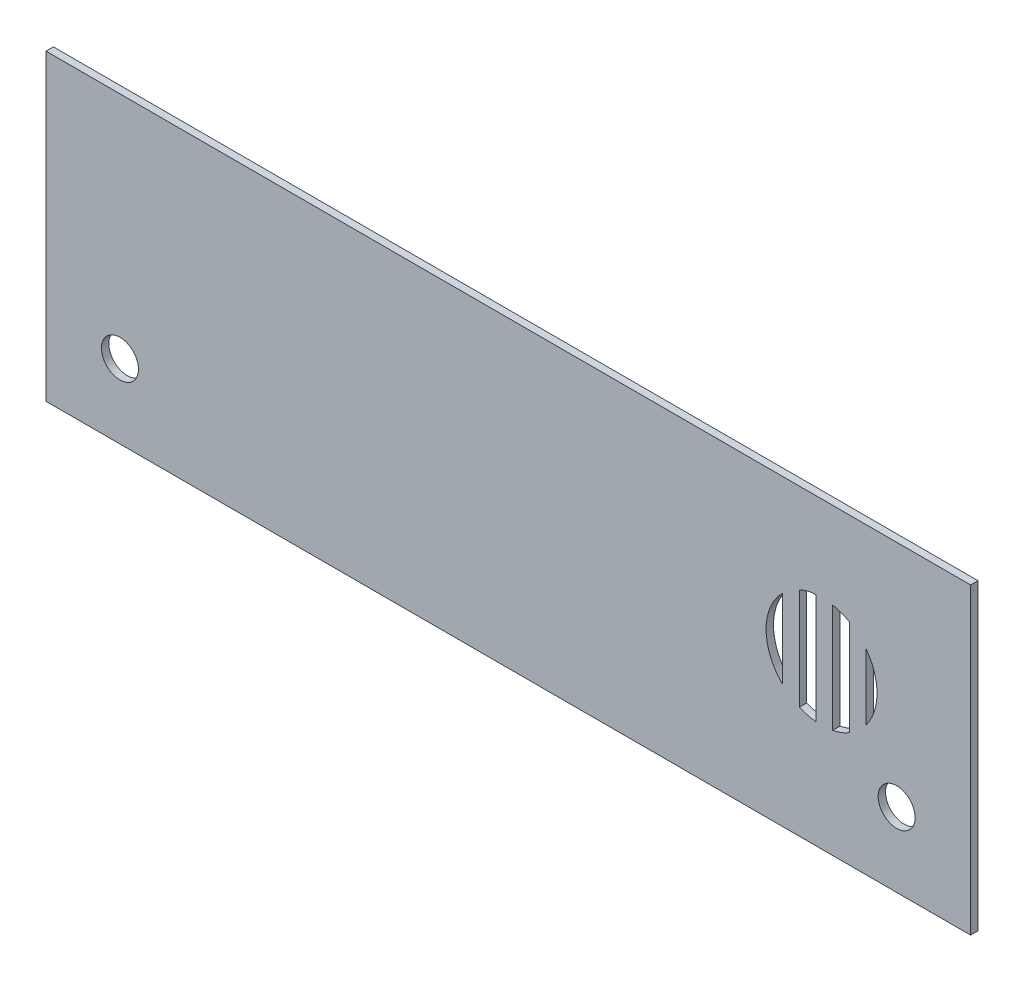
ISO-10303-21;
HEADER;
FILE_DESCRIPTION(('STEP AP214'),'2;1');
FILE_NAME('part.step','',(''),(''),'','','');
FILE_SCHEMA(('AUTOMOTIVE_DESIGN { 1 0 10303 214 1 1 1 1 }'));
ENDSEC;
DATA;
#1=APPLICATION_CONTEXT('core data for automotive mechanical design processes');
#2=APPLICATION_PROTOCOL_DEFINITION('international standard','automotive_design',2000,#1);
#3=PRODUCT_CONTEXT('',#1,'mechanical');
#4=PRODUCT('Part','Part','',(#3));
#5=PRODUCT_RELATED_PRODUCT_CATEGORY('part','',(#4));
#6=PRODUCT_DEFINITION_FORMATION('','',#4);
#7=PRODUCT_DEFINITION_CONTEXT('part definition',#1,'design');
#8=PRODUCT_DEFINITION('design','',#6,#7);
#9=PRODUCT_DEFINITION_SHAPE('','',#8);
#10=(LENGTH_UNIT() NAMED_UNIT(*) SI_UNIT(.MILLI.,.METRE.));
#11=(NAMED_UNIT(*) PLANE_ANGLE_UNIT() SI_UNIT($,.RADIAN.));
#12=(NAMED_UNIT(*) SI_UNIT($,.STERADIAN.) SOLID_ANGLE_UNIT());
#13=UNCERTAINTY_MEASURE_WITH_UNIT(LENGTH_MEASURE(1.E-05),#10,'distance_accuracy_value','');
#14=(GEOMETRIC_REPRESENTATION_CONTEXT(3) GLOBAL_UNCERTAINTY_ASSIGNED_CONTEXT((#13)) GLOBAL_UNIT_ASSIGNED_CONTEXT((#10,
#11,#12)) REPRESENTATION_CONTEXT('',''));
#15=CARTESIAN_POINT('',(0.,0.,0.));
#16=DIRECTION('',(0.,0.,1.));
#17=DIRECTION('',(1.,0.,0.));
#18=AXIS2_PLACEMENT_3D('',#15,#16,#17);
#19=CARTESIAN_POINT('',(0.,0.,2.));
#20=DIRECTION('',(0.,0.,1.));
#21=DIRECTION('',(1.,0.,0.));
#22=AXIS2_PLACEMENT_3D('',#19,#20,#21);
#23=PLANE('',#22);
#24=CARTESIAN_POINT('',(105.,-21.,2.));
#25=DIRECTION('',(0.,0.,1.));
#26=DIRECTION('',(1.,0.,0.));
#27=AXIS2_PLACEMENT_3D('',#24,#25,#26);
#28=CIRCLE('',#27,5.);
#29=CARTESIAN_POINT('',(110.,-21.,2.));
#30=VERTEX_POINT('',#29);
#31=EDGE_CURVE('E293',#30,#30,#28,.T.);
#32=ORIENTED_EDGE('',*,*,#31,.F.);
#33=EDGE_LOOP('',(#32));
#34=FACE_BOUND('',#33,.T.);
#35=CARTESIAN_POINT('',(-105.,-21.,2.));
#36=DIRECTION('',(0.,0.,1.));
#37=DIRECTION('',(1.,0.,0.));
#38=AXIS2_PLACEMENT_3D('',#35,#36,#37);
#39=CIRCLE('',#38,5.);
#40=CARTESIAN_POINT('',(-100.,-21.,2.));
#41=VERTEX_POINT('',#40);
#42=EDGE_CURVE('E285',#41,#41,#39,.T.);
#43=ORIENTED_EDGE('',*,*,#42,.F.);
#44=EDGE_LOOP('',(#43));
#45=FACE_BOUND('',#44,.T.);
#46=DIRECTION('',(0.,-1.,0.));
#47=VECTOR('',#46,1.);
#48=CARTESIAN_POINT('',(96.695797737044,0.,2.));
#49=LINE('',#48,#47);
#50=CARTESIAN_POINT('',(96.695797737044,11.9837804555939,2.));
#51=VERTEX_POINT('',#50);
#52=CARTESIAN_POINT('',(96.695797737044,-6.01621954440613,2.));
#53=VERTEX_POINT('',#52);
#54=EDGE_CURVE('E205',#51,#53,#49,.T.);
#55=ORIENTED_EDGE('',*,*,#54,.F.);
#56=CARTESIAN_POINT('',(84.695797737044,2.98378045559389,2.));
#57=DIRECTION('',(0.,0.,1.));
#58=DIRECTION('',(1.,0.,0.));
#59=AXIS2_PLACEMENT_3D('',#56,#57,#58);
#60=CIRCLE('',#59,15.);
#61=EDGE_CURVE('E207',#53,#51,#60,.T.);
#62=ORIENTED_EDGE('',*,*,#61,.F.);
#63=EDGE_LOOP('',(#55,#62));
#64=FACE_BOUND('',#63,.T.);
#65=DIRECTION('',(0.,1.,0.));
#66=VECTOR('',#65,1.);
#67=CARTESIAN_POINT('',(125.,41.,2.));
#68=LINE('',#67,#66);
#69=CARTESIAN_POINT('',(125.,-41.,2.));
#70=VERTEX_POINT('',#69);
#71=CARTESIAN_POINT('',(125.,41.,2.));
#72=VERTEX_POINT('',#71);
#73=EDGE_CURVE('E226',#70,#72,#68,.T.);
#74=ORIENTED_EDGE('',*,*,#73,.T.);
#75=DIRECTION('',(-1.,0.,0.));
#76=VECTOR('',#75,1.);
#77=CARTESIAN_POINT('',(-125.,41.,2.));
#78=LINE('',#77,#76);
#79=CARTESIAN_POINT('',(-125.,41.,2.));
#80=VERTEX_POINT('',#79);
#81=EDGE_CURVE('E229',#72,#80,#78,.T.);
#82=ORIENTED_EDGE('',*,*,#81,.T.);
#83=DIRECTION('',(0.,-1.,0.));
#84=VECTOR('',#83,1.);
#85=CARTESIAN_POINT('',(-125.,41.,2.));
#86=LINE('',#85,#84);
#87=CARTESIAN_POINT('',(-125.,-41.,2.));
#88=VERTEX_POINT('',#87);
#89=EDGE_CURVE('E232',#80,#88,#86,.T.);
#90=ORIENTED_EDGE('',*,*,#89,.T.);
#91=DIRECTION('',(1.,0.,0.));
#92=VECTOR('',#91,1.);
#93=CARTESIAN_POINT('',(-125.,-41.,2.));
#94=LINE('',#93,#92);
#95=EDGE_CURVE('E234',#88,#70,#94,.T.);
#96=ORIENTED_EDGE('',*,*,#95,.T.);
#97=EDGE_LOOP('',(#74,#82,#90,#96));
#98=FACE_BOUND('',#97,.T.);
#99=CARTESIAN_POINT('',(84.695797737044,2.98378045559389,2.));
#100=DIRECTION('',(0.,0.,1.));
#101=DIRECTION('',(1.,0.,0.));
#102=AXIS2_PLACEMENT_3D('',#99,#100,#101);
#103=CIRCLE('',#102,15.);
#104=CARTESIAN_POINT('',(74.1957977370438,13.695923098408,2.));
#105=VERTEX_POINT('',#104);
#106=CARTESIAN_POINT('',(74.1957977370438,-7.72836218722021,2.));
#107=VERTEX_POINT('',#106);
#108=EDGE_CURVE('E217',#105,#107,#103,.T.);
#109=ORIENTED_EDGE('',*,*,#108,.F.);
#110=DIRECTION('',(0.,-1.,0.));
#111=VECTOR('',#110,1.);
#112=CARTESIAN_POINT('',(74.1957977370438,0.,2.));
#113=LINE('',#112,#111);
#114=EDGE_CURVE('E183',#105,#107,#113,.T.);
#115=ORIENTED_EDGE('',*,*,#114,.T.);
#116=EDGE_LOOP('',(#109,#115));
#117=FACE_BOUND('',#116,.T.);
#118=CARTESIAN_POINT('',(84.695797737044,2.98378045559389,2.));
#119=DIRECTION('',(0.,0.,1.));
#120=DIRECTION('',(1.,0.,0.));
#121=AXIS2_PLACEMENT_3D('',#118,#119,#120);
#122=CIRCLE('',#121,15.);
#123=CARTESIAN_POINT('',(92.1957977370439,15.9741615123605,2.));
#124=VERTEX_POINT('',#123);
#125=CARTESIAN_POINT('',(87.6957977370439,17.680718912293,2.));
#126=VERTEX_POINT('',#125);
#127=EDGE_CURVE('E189',#124,#126,#122,.T.);
#128=ORIENTED_EDGE('',*,*,#127,.F.);
#129=DIRECTION('',(0.,-1.,0.));
#130=VECTOR('',#129,1.);
#131=CARTESIAN_POINT('',(92.1957977370439,0.,2.));
#132=LINE('',#131,#130);
#133=CARTESIAN_POINT('',(92.1957977370439,-10.0066006011727,2.));
#134=VERTEX_POINT('',#133);
#135=EDGE_CURVE('E57',#124,#134,#132,.T.);
#136=ORIENTED_EDGE('',*,*,#135,.T.);
#137=CARTESIAN_POINT('',(87.6957977370439,-11.7131580011052,2.));
#138=VERTEX_POINT('',#137);
#139=EDGE_CURVE('E194',#138,#134,#122,.T.);
#140=ORIENTED_EDGE('',*,*,#139,.F.);
#141=DIRECTION('',(0.,-1.,0.));
#142=VECTOR('',#141,1.);
#143=CARTESIAN_POINT('',(87.6957977370439,0.,2.));
#144=LINE('',#143,#142);
#145=EDGE_CURVE('E193',#126,#138,#144,.T.);
#146=ORIENTED_EDGE('',*,*,#145,.F.);
#147=EDGE_LOOP('',(#128,#136,#140,#146));
#148=FACE_BOUND('',#147,.T.);
#149=CARTESIAN_POINT('',(84.695797737044,2.98378045559389,2.));
#150=DIRECTION('',(0.,0.,1.));
#151=DIRECTION('',(1.,0.,0.));
#152=AXIS2_PLACEMENT_3D('',#149,#150,#151);
#153=CIRCLE('',#152,15.);
#154=CARTESIAN_POINT('',(82.1938489308077,17.7736503729046,2.));
#155=VERTEX_POINT('',#154);
#156=CARTESIAN_POINT('',(78.6957977370438,16.7315075404613,2.));
#157=VERTEX_POINT('',#156);
#158=EDGE_CURVE('E169',#155,#157,#153,.T.);
#159=ORIENTED_EDGE('',*,*,#158,.F.);
#160=DIRECTION('',(1.,0.,0.));
#161=VECTOR('',#160,1.);
#162=CARTESIAN_POINT('',(0.,17.7736503729046,2.));
#163=LINE('',#162,#161);
#164=CARTESIAN_POINT('',(83.1957977370439,17.7736503729046,2.));
#165=VERTEX_POINT('',#164);
#166=EDGE_CURVE('E49',#155,#165,#163,.T.);
#167=ORIENTED_EDGE('',*,*,#166,.T.);
#168=DIRECTION('',(0.,-1.,0.));
#169=VECTOR('',#168,1.);
#170=CARTESIAN_POINT('',(83.1957977370439,0.,2.));
#171=LINE('',#170,#169);
#172=CARTESIAN_POINT('',(83.1957977370439,-11.9410311010054,2.));
#173=VERTEX_POINT('',#172);
#174=EDGE_CURVE('E177',#165,#173,#171,.T.);
#175=ORIENTED_EDGE('',*,*,#174,.T.);
#176=CARTESIAN_POINT('',(78.6957977370438,-10.7639466292736,2.));
#177=VERTEX_POINT('',#176);
#178=EDGE_CURVE('E173',#177,#173,#153,.T.);
#179=ORIENTED_EDGE('',*,*,#178,.F.);
#180=DIRECTION('',(0.,-1.,0.));
#181=VECTOR('',#180,1.);
#182=CARTESIAN_POINT('',(78.6957977370438,0.,2.));
#183=LINE('',#182,#181);
#184=EDGE_CURVE('E159',#157,#177,#183,.T.);
#185=ORIENTED_EDGE('',*,*,#184,.F.);
#186=EDGE_LOOP('',(#159,#167,#175,#179,#185));
#187=FACE_BOUND('',#186,.T.);
#188=ADVANCED_FACE('F32',(#34,#45,#64,#98,#117,#148,#187),#23,.T.);
#189=CARTESIAN_POINT('',(0.,0.,0.));
#190=DIRECTION('',(0.,0.,1.));
#191=DIRECTION('',(1.,0.,0.));
#192=AXIS2_PLACEMENT_3D('',#189,#190,#191);
#193=PLANE('',#192);
#194=CARTESIAN_POINT('',(105.,-21.,0.));
#195=DIRECTION('',(0.,0.,1.));
#196=DIRECTION('',(1.,0.,0.));
#197=AXIS2_PLACEMENT_3D('',#194,#195,#196);
#198=CIRCLE('',#197,5.);
#199=CARTESIAN_POINT('',(110.,-21.,0.));
#200=VERTEX_POINT('',#199);
#201=EDGE_CURVE('E36',#200,#200,#198,.T.);
#202=ORIENTED_EDGE('',*,*,#201,.T.);
#203=EDGE_LOOP('',(#202));
#204=FACE_BOUND('',#203,.T.);
#205=CARTESIAN_POINT('',(-105.,-21.,0.));
#206=DIRECTION('',(0.,0.,1.));
#207=DIRECTION('',(1.,0.,0.));
#208=AXIS2_PLACEMENT_3D('',#205,#206,#207);
#209=CIRCLE('',#208,5.);
#210=CARTESIAN_POINT('',(-100.,-21.,0.));
#211=VERTEX_POINT('',#210);
#212=EDGE_CURVE('E208',#211,#211,#209,.T.);
#213=ORIENTED_EDGE('',*,*,#212,.T.);
#214=EDGE_LOOP('',(#213));
#215=FACE_BOUND('',#214,.T.);
#216=DIRECTION('',(0.,-1.,0.));
#217=VECTOR('',#216,1.);
#218=CARTESIAN_POINT('',(92.1957977370439,0.,0.));
#219=LINE('',#218,#217);
#220=CARTESIAN_POINT('',(92.1957977370439,15.9741615123605,0.));
#221=VERTEX_POINT('',#220);
#222=CARTESIAN_POINT('',(92.1957977370439,-10.0066006011727,0.));
#223=VERTEX_POINT('',#222);
#224=EDGE_CURVE('E276',#221,#223,#219,.T.);
#225=ORIENTED_EDGE('',*,*,#224,.F.);
#226=CARTESIAN_POINT('',(84.695797737044,2.98378045559389,0.));
#227=DIRECTION('',(0.,0.,1.));
#228=DIRECTION('',(1.,0.,0.));
#229=AXIS2_PLACEMENT_3D('',#226,#227,#228);
#230=CIRCLE('',#229,15.);
#231=CARTESIAN_POINT('',(87.6957977370439,17.680718912293,0.));
#232=VERTEX_POINT('',#231);
#233=EDGE_CURVE('E267',#221,#232,#230,.T.);
#234=ORIENTED_EDGE('',*,*,#233,.T.);
#235=DIRECTION('',(0.,-1.,0.));
#236=VECTOR('',#235,1.);
#237=CARTESIAN_POINT('',(87.6957977370439,0.,0.));
#238=LINE('',#237,#236);
#239=CARTESIAN_POINT('',(87.6957977370439,-11.7131580011052,0.));
#240=VERTEX_POINT('',#239);
#241=EDGE_CURVE('E270',#232,#240,#238,.T.);
#242=ORIENTED_EDGE('',*,*,#241,.T.);
#243=CARTESIAN_POINT('',(84.695797737044,2.98378045559389,0.));
#244=DIRECTION('',(0.,0.,1.));
#245=DIRECTION('',(1.,0.,0.));
#246=AXIS2_PLACEMENT_3D('',#243,#244,#245);
#247=CIRCLE('',#246,15.);
#248=EDGE_CURVE('E273',#240,#223,#247,.T.);
#249=ORIENTED_EDGE('',*,*,#248,.T.);
#250=EDGE_LOOP('',(#225,#234,#242,#249));
#251=FACE_BOUND('',#250,.T.);
#252=CARTESIAN_POINT('',(84.695797737044,2.98378045559389,0.));
#253=DIRECTION('',(0.,0.,1.));
#254=DIRECTION('',(1.,0.,0.));
#255=AXIS2_PLACEMENT_3D('',#252,#253,#254);
#256=CIRCLE('',#255,15.);
#257=CARTESIAN_POINT('',(96.695797737044,-6.01621954440613,0.));
#258=VERTEX_POINT('',#257);
#259=CARTESIAN_POINT('',(96.695797737044,11.9837804555939,0.));
#260=VERTEX_POINT('',#259);
#261=EDGE_CURVE('E261',#258,#260,#256,.T.);
#262=ORIENTED_EDGE('',*,*,#261,.T.);
#263=DIRECTION('',(0.,-1.,0.));
#264=VECTOR('',#263,1.);
#265=CARTESIAN_POINT('',(96.695797737044,0.,0.));
#266=LINE('',#265,#264);
#267=EDGE_CURVE('E264',#260,#258,#266,.T.);
#268=ORIENTED_EDGE('',*,*,#267,.T.);
#269=EDGE_LOOP('',(#262,#268));
#270=FACE_BOUND('',#269,.T.);
#271=DIRECTION('',(0.,1.,0.));
#272=VECTOR('',#271,1.);
#273=CARTESIAN_POINT('',(125.,41.,0.));
#274=LINE('',#273,#272);
#275=CARTESIAN_POINT('',(125.,-41.,0.));
#276=VERTEX_POINT('',#275);
#277=CARTESIAN_POINT('',(125.,41.,0.));
#278=VERTEX_POINT('',#277);
#279=EDGE_CURVE('E223',#276,#278,#274,.T.);
#280=ORIENTED_EDGE('',*,*,#279,.F.);
#281=DIRECTION('',(1.,0.,0.));
#282=VECTOR('',#281,1.);
#283=CARTESIAN_POINT('',(-125.,-41.,0.));
#284=LINE('',#283,#282);
#285=CARTESIAN_POINT('',(-125.,-41.,0.));
#286=VERTEX_POINT('',#285);
#287=EDGE_CURVE('E230',#286,#276,#284,.T.);
#288=ORIENTED_EDGE('',*,*,#287,.F.);
#289=DIRECTION('',(0.,-1.,0.));
#290=VECTOR('',#289,1.);
#291=CARTESIAN_POINT('',(-125.,41.,0.));
#292=LINE('',#291,#290);
#293=CARTESIAN_POINT('',(-125.,41.,0.));
#294=VERTEX_POINT('',#293);
#295=EDGE_CURVE('E241',#294,#286,#292,.T.);
#296=ORIENTED_EDGE('',*,*,#295,.F.);
#297=DIRECTION('',(-1.,0.,0.));
#298=VECTOR('',#297,1.);
#299=CARTESIAN_POINT('',(-125.,41.,0.));
#300=LINE('',#299,#298);
#301=EDGE_CURVE('E239',#278,#294,#300,.T.);
#302=ORIENTED_EDGE('',*,*,#301,.F.);
#303=EDGE_LOOP('',(#280,#288,#296,#302));
#304=FACE_BOUND('',#303,.T.);
#305=DIRECTION('',(0.,-1.,0.));
#306=VECTOR('',#305,1.);
#307=CARTESIAN_POINT('',(74.1957977370438,0.,0.));
#308=LINE('',#307,#306);
#309=CARTESIAN_POINT('',(74.1957977370438,13.695923098408,0.));
#310=VERTEX_POINT('',#309);
#311=CARTESIAN_POINT('',(74.1957977370438,-7.72836218722021,0.));
#312=VERTEX_POINT('',#311);
#313=EDGE_CURVE('E258',#310,#312,#308,.T.);
#314=ORIENTED_EDGE('',*,*,#313,.F.);
#315=CARTESIAN_POINT('',(84.695797737044,2.98378045559389,0.));
#316=DIRECTION('',(0.,0.,1.));
#317=DIRECTION('',(1.,0.,0.));
#318=AXIS2_PLACEMENT_3D('',#315,#316,#317);
#319=CIRCLE('',#318,15.);
#320=EDGE_CURVE('E255',#310,#312,#319,.T.);
#321=ORIENTED_EDGE('',*,*,#320,.T.);
#322=EDGE_LOOP('',(#314,#321));
#323=FACE_BOUND('',#322,.T.);
#324=DIRECTION('',(1.,0.,0.));
#325=VECTOR('',#324,1.);
#326=CARTESIAN_POINT('',(0.,17.7736503729046,0.));
#327=LINE('',#326,#325);
#328=CARTESIAN_POINT('',(82.1938489308077,17.7736503729046,0.));
#329=VERTEX_POINT('',#328);
#330=CARTESIAN_POINT('',(83.1957977370439,17.7736503729046,0.));
#331=VERTEX_POINT('',#330);
#332=EDGE_CURVE('E11',#329,#331,#327,.T.);
#333=ORIENTED_EDGE('',*,*,#332,.F.);
#334=CARTESIAN_POINT('',(84.695797737044,2.98378045559389,0.));
#335=DIRECTION('',(0.,0.,1.));
#336=DIRECTION('',(1.,0.,0.));
#337=AXIS2_PLACEMENT_3D('',#334,#335,#336);
#338=CIRCLE('',#337,15.);
#339=CARTESIAN_POINT('',(78.6957977370438,16.7315075404613,0.));
#340=VERTEX_POINT('',#339);
#341=EDGE_CURVE('E278',#329,#340,#338,.T.);
#342=ORIENTED_EDGE('',*,*,#341,.T.);
#343=DIRECTION('',(0.,-1.,0.));
#344=VECTOR('',#343,1.);
#345=CARTESIAN_POINT('',(78.6957977370438,0.,0.));
#346=LINE('',#345,#344);
#347=CARTESIAN_POINT('',(78.6957977370438,-10.7639466292736,0.));
#348=VERTEX_POINT('',#347);
#349=EDGE_CURVE('E162',#340,#348,#346,.T.);
#350=ORIENTED_EDGE('',*,*,#349,.T.);
#351=CARTESIAN_POINT('',(84.695797737044,2.98378045559389,0.));
#352=DIRECTION('',(0.,0.,1.));
#353=DIRECTION('',(1.,0.,0.));
#354=AXIS2_PLACEMENT_3D('',#351,#352,#353);
#355=CIRCLE('',#354,15.);
#356=CARTESIAN_POINT('',(83.1957977370439,-11.9410311010054,0.));
#357=VERTEX_POINT('',#356);
#358=EDGE_CURVE('E281',#348,#357,#355,.T.);
#359=ORIENTED_EDGE('',*,*,#358,.T.);
#360=DIRECTION('',(0.,-1.,0.));
#361=VECTOR('',#360,1.);
#362=CARTESIAN_POINT('',(83.1957977370439,0.,0.));
#363=LINE('',#362,#361);
#364=EDGE_CURVE('E41',#331,#357,#363,.T.);
#365=ORIENTED_EDGE('',*,*,#364,.F.);
#366=EDGE_LOOP('',(#333,#342,#350,#359,#365));
#367=FACE_BOUND('',#366,.T.);
#368=ADVANCED_FACE('F305',(#204,#215,#251,#270,#304,#323,#367),#193,.F.);
#369=CARTESIAN_POINT('',(125.,41.,2.));
#370=DIRECTION('',(-1.,0.,0.));
#371=DIRECTION('',(0.,0.,1.));
#372=AXIS2_PLACEMENT_3D('',#369,#370,#371);
#373=PLANE('',#372);
#374=ORIENTED_EDGE('',*,*,#279,.T.);
#375=DIRECTION('',(0.,0.,-1.));
#376=VECTOR('',#375,1.);
#377=CARTESIAN_POINT('',(125.,41.,2.));
#378=LINE('',#377,#376);
#379=EDGE_CURVE('E252',#72,#278,#378,.T.);
#380=ORIENTED_EDGE('',*,*,#379,.F.);
#381=ORIENTED_EDGE('',*,*,#73,.F.);
#382=DIRECTION('',(0.,0.,-1.));
#383=VECTOR('',#382,1.);
#384=CARTESIAN_POINT('',(125.,-41.,2.));
#385=LINE('',#384,#383);
#386=EDGE_CURVE('E236',#70,#276,#385,.T.);
#387=ORIENTED_EDGE('',*,*,#386,.T.);
#388=EDGE_LOOP('',(#374,#380,#381,#387));
#389=FACE_BOUND('',#388,.T.);
#390=ADVANCED_FACE('F34',(#389),#373,.F.);
#391=CARTESIAN_POINT('',(-125.,41.,2.));
#392=DIRECTION('',(0.,-1.,0.));
#393=DIRECTION('',(0.,0.,-1.));
#394=AXIS2_PLACEMENT_3D('',#391,#392,#393);
#395=PLANE('',#394);
#396=ORIENTED_EDGE('',*,*,#301,.T.);
#397=DIRECTION('',(0.,0.,-1.));
#398=VECTOR('',#397,1.);
#399=CARTESIAN_POINT('',(-125.,41.,2.));
#400=LINE('',#399,#398);
#401=EDGE_CURVE('E249',#80,#294,#400,.T.);
#402=ORIENTED_EDGE('',*,*,#401,.F.);
#403=ORIENTED_EDGE('',*,*,#81,.F.);
#404=ORIENTED_EDGE('',*,*,#379,.T.);
#405=EDGE_LOOP('',(#396,#402,#403,#404));
#406=FACE_BOUND('',#405,.T.);
#407=ADVANCED_FACE('F340',(#406),#395,.F.);
#408=CARTESIAN_POINT('',(-125.,41.,2.));
#409=DIRECTION('',(1.,0.,0.));
#410=DIRECTION('',(0.,0.,-1.));
#411=AXIS2_PLACEMENT_3D('',#408,#409,#410);
#412=PLANE('',#411);
#413=ORIENTED_EDGE('',*,*,#295,.T.);
#414=DIRECTION('',(0.,0.,-1.));
#415=VECTOR('',#414,1.);
#416=CARTESIAN_POINT('',(-125.,-41.,2.));
#417=LINE('',#416,#415);
#418=EDGE_CURVE('E246',#88,#286,#417,.T.);
#419=ORIENTED_EDGE('',*,*,#418,.F.);
#420=ORIENTED_EDGE('',*,*,#89,.F.);
#421=ORIENTED_EDGE('',*,*,#401,.T.);
#422=EDGE_LOOP('',(#413,#419,#420,#421));
#423=FACE_BOUND('',#422,.T.);
#424=ADVANCED_FACE('F337',(#423),#412,.F.);
#425=CARTESIAN_POINT('',(-125.,-41.,2.));
#426=DIRECTION('',(0.,1.,0.));
#427=DIRECTION('',(0.,0.,1.));
#428=AXIS2_PLACEMENT_3D('',#425,#426,#427);
#429=PLANE('',#428);
#430=ORIENTED_EDGE('',*,*,#287,.T.);
#431=ORIENTED_EDGE('',*,*,#386,.F.);
#432=ORIENTED_EDGE('',*,*,#95,.F.);
#433=ORIENTED_EDGE('',*,*,#418,.T.);
#434=EDGE_LOOP('',(#430,#431,#432,#433));
#435=FACE_BOUND('',#434,.T.);
#436=ADVANCED_FACE('F334',(#435),#429,.F.);
#437=CARTESIAN_POINT('',(74.1957977370438,0.,-1.));
#438=DIRECTION('',(-1.,0.,0.));
#439=DIRECTION('',(0.,0.,1.));
#440=AXIS2_PLACEMENT_3D('',#437,#438,#439);
#441=PLANE('',#440);
#442=ORIENTED_EDGE('',*,*,#313,.T.);
#443=DIRECTION('',(0.,0.,1.));
#444=VECTOR('',#443,1.);
#445=CARTESIAN_POINT('',(74.1957977370438,-7.72836218722021,-1.));
#446=LINE('',#445,#444);
#447=EDGE_CURVE('E221',#312,#107,#446,.T.);
#448=ORIENTED_EDGE('',*,*,#447,.T.);
#449=ORIENTED_EDGE('',*,*,#114,.F.);
#450=DIRECTION('',(0.,0.,1.));
#451=VECTOR('',#450,1.);
#452=CARTESIAN_POINT('',(74.1957977370438,13.695923098408,-1.));
#453=LINE('',#452,#451);
#454=EDGE_CURVE('E220',#310,#105,#453,.T.);
#455=ORIENTED_EDGE('',*,*,#454,.F.);
#456=EDGE_LOOP('',(#442,#448,#449,#455));
#457=FACE_BOUND('',#456,.T.);
#458=ADVANCED_FACE('F331',(#457),#441,.T.);
#459=CARTESIAN_POINT('',(84.695797737044,2.98378045559389,-1.));
#460=DIRECTION('',(0.,0.,1.));
#461=DIRECTION('',(1.,0.,0.));
#462=AXIS2_PLACEMENT_3D('',#459,#460,#461);
#463=CYLINDRICAL_SURFACE('',#462,15.);
#464=ORIENTED_EDGE('',*,*,#454,.T.);
#465=ORIENTED_EDGE('',*,*,#108,.T.);
#466=ORIENTED_EDGE('',*,*,#447,.F.);
#467=ORIENTED_EDGE('',*,*,#320,.F.);
#468=EDGE_LOOP('',(#464,#465,#466,#467));
#469=FACE_BOUND('',#468,.T.);
#470=ADVANCED_FACE('F391',(#469),#463,.F.);
#471=CARTESIAN_POINT('',(96.695797737044,0.,-1.));
#472=DIRECTION('',(-1.,0.,0.));
#473=DIRECTION('',(0.,0.,1.));
#474=AXIS2_PLACEMENT_3D('',#471,#472,#473);
#475=PLANE('',#474);
#476=DIRECTION('',(0.,0.,1.));
#477=VECTOR('',#476,1.);
#478=CARTESIAN_POINT('',(96.695797737044,11.9837804555939,-1.));
#479=LINE('',#478,#477);
#480=EDGE_CURVE('E190',#260,#51,#479,.T.);
#481=ORIENTED_EDGE('',*,*,#480,.T.);
#482=ORIENTED_EDGE('',*,*,#54,.T.);
#483=DIRECTION('',(0.,0.,1.));
#484=VECTOR('',#483,1.);
#485=CARTESIAN_POINT('',(96.695797737044,-6.01621954440613,-1.));
#486=LINE('',#485,#484);
#487=EDGE_CURVE('E211',#258,#53,#486,.T.);
#488=ORIENTED_EDGE('',*,*,#487,.F.);
#489=ORIENTED_EDGE('',*,*,#267,.F.);
#490=EDGE_LOOP('',(#481,#482,#488,#489));
#491=FACE_BOUND('',#490,.T.);
#492=ADVANCED_FACE('F388',(#491),#475,.F.);
#493=CARTESIAN_POINT('',(84.695797737044,2.98378045559389,-1.));
#494=DIRECTION('',(0.,0.,1.));
#495=DIRECTION('',(1.,0.,0.));
#496=AXIS2_PLACEMENT_3D('',#493,#494,#495);
#497=CYLINDRICAL_SURFACE('',#496,15.);
#498=ORIENTED_EDGE('',*,*,#487,.T.);
#499=ORIENTED_EDGE('',*,*,#61,.T.);
#500=ORIENTED_EDGE('',*,*,#480,.F.);
#501=ORIENTED_EDGE('',*,*,#261,.F.);
#502=EDGE_LOOP('',(#498,#499,#500,#501));
#503=FACE_BOUND('',#502,.T.);
#504=ADVANCED_FACE('F385',(#503),#497,.F.);
#505=CARTESIAN_POINT('',(92.1957977370439,0.,-1.));
#506=DIRECTION('',(-1.,0.,0.));
#507=DIRECTION('',(0.,0.,1.));
#508=AXIS2_PLACEMENT_3D('',#505,#506,#507);
#509=PLANE('',#508);
#510=ORIENTED_EDGE('',*,*,#224,.T.);
#511=DIRECTION('',(0.,0.,1.));
#512=VECTOR('',#511,1.);
#513=CARTESIAN_POINT('',(92.1957977370439,-10.0066006011727,-1.));
#514=LINE('',#513,#512);
#515=EDGE_CURVE('E197',#223,#134,#514,.T.);
#516=ORIENTED_EDGE('',*,*,#515,.T.);
#517=ORIENTED_EDGE('',*,*,#135,.F.);
#518=DIRECTION('',(0.,0.,1.));
#519=VECTOR('',#518,1.);
#520=CARTESIAN_POINT('',(92.1957977370439,15.9741615123605,-1.));
#521=LINE('',#520,#519);
#522=EDGE_CURVE('E203',#221,#124,#521,.T.);
#523=ORIENTED_EDGE('',*,*,#522,.F.);
#524=EDGE_LOOP('',(#510,#516,#517,#523));
#525=FACE_BOUND('',#524,.T.);
#526=ADVANCED_FACE('F369',(#525),#509,.T.);
#527=CARTESIAN_POINT('',(84.695797737044,2.98378045559389,-1.));
#528=DIRECTION('',(0.,0.,1.));
#529=DIRECTION('',(1.,0.,0.));
#530=AXIS2_PLACEMENT_3D('',#527,#528,#529);
#531=CYLINDRICAL_SURFACE('',#530,15.);
#532=DIRECTION('',(0.,0.,1.));
#533=VECTOR('',#532,1.);
#534=CARTESIAN_POINT('',(87.6957977370439,-11.7131580011052,-1.));
#535=LINE('',#534,#533);
#536=EDGE_CURVE('E199',#240,#138,#535,.T.);
#537=ORIENTED_EDGE('',*,*,#536,.T.);
#538=ORIENTED_EDGE('',*,*,#139,.T.);
#539=ORIENTED_EDGE('',*,*,#515,.F.);
#540=ORIENTED_EDGE('',*,*,#248,.F.);
#541=EDGE_LOOP('',(#537,#538,#539,#540));
#542=FACE_BOUND('',#541,.T.);
#543=ADVANCED_FACE('F318',(#542),#531,.F.);
#544=CARTESIAN_POINT('',(87.6957977370439,0.,-1.));
#545=DIRECTION('',(-1.,0.,0.));
#546=DIRECTION('',(0.,0.,1.));
#547=AXIS2_PLACEMENT_3D('',#544,#545,#546);
#548=PLANE('',#547);
#549=DIRECTION('',(0.,0.,1.));
#550=VECTOR('',#549,1.);
#551=CARTESIAN_POINT('',(87.6957977370439,17.680718912293,-1.));
#552=LINE('',#551,#550);
#553=EDGE_CURVE('E201',#232,#126,#552,.T.);
#554=ORIENTED_EDGE('',*,*,#553,.T.);
#555=ORIENTED_EDGE('',*,*,#145,.T.);
#556=ORIENTED_EDGE('',*,*,#536,.F.);
#557=ORIENTED_EDGE('',*,*,#241,.F.);
#558=EDGE_LOOP('',(#554,#555,#556,#557));
#559=FACE_BOUND('',#558,.T.);
#560=ADVANCED_FACE('F315',(#559),#548,.F.);
#561=ORIENTED_EDGE('',*,*,#522,.T.);
#562=ORIENTED_EDGE('',*,*,#127,.T.);
#563=ORIENTED_EDGE('',*,*,#553,.F.);
#564=ORIENTED_EDGE('',*,*,#233,.F.);
#565=EDGE_LOOP('',(#561,#562,#563,#564));
#566=FACE_BOUND('',#565,.T.);
#567=ADVANCED_FACE('F308',(#566),#531,.F.);
#568=CARTESIAN_POINT('',(0.,17.7736503729046,-1.));
#569=DIRECTION('',(0.,-1.,0.));
#570=DIRECTION('',(1.,0.,0.));
#571=AXIS2_PLACEMENT_3D('',#568,#569,#570);
#572=PLANE('',#571);
#573=ORIENTED_EDGE('',*,*,#332,.T.);
#574=DIRECTION('',(0.,0.,1.));
#575=VECTOR('',#574,1.);
#576=CARTESIAN_POINT('',(83.1957977370439,17.7736503729046,-1.));
#577=LINE('',#576,#575);
#578=EDGE_CURVE('E181',#331,#165,#577,.T.);
#579=ORIENTED_EDGE('',*,*,#578,.T.);
#580=ORIENTED_EDGE('',*,*,#166,.F.);
#581=DIRECTION('',(0.,0.,1.));
#582=VECTOR('',#581,1.);
#583=CARTESIAN_POINT('',(82.1938489308077,17.7736503729046,-1.));
#584=LINE('',#583,#582);
#585=EDGE_CURVE('E166',#329,#155,#584,.T.);
#586=ORIENTED_EDGE('',*,*,#585,.F.);
#587=EDGE_LOOP('',(#573,#579,#580,#586));
#588=FACE_BOUND('',#587,.T.);
#589=ADVANCED_FACE('F306',(#588),#572,.T.);
#590=CARTESIAN_POINT('',(83.1957977370439,0.,-1.));
#591=DIRECTION('',(-1.,0.,0.));
#592=DIRECTION('',(0.,0.,1.));
#593=AXIS2_PLACEMENT_3D('',#590,#591,#592);
#594=PLANE('',#593);
#595=ORIENTED_EDGE('',*,*,#364,.T.);
#596=DIRECTION('',(0.,0.,1.));
#597=VECTOR('',#596,1.);
#598=CARTESIAN_POINT('',(83.1957977370439,-11.9410311010054,-1.));
#599=LINE('',#598,#597);
#600=EDGE_CURVE('E184',#357,#173,#599,.T.);
#601=ORIENTED_EDGE('',*,*,#600,.T.);
#602=ORIENTED_EDGE('',*,*,#174,.F.);
#603=ORIENTED_EDGE('',*,*,#578,.F.);
#604=EDGE_LOOP('',(#595,#601,#602,#603));
#605=FACE_BOUND('',#604,.T.);
#606=ADVANCED_FACE('F298',(#605),#594,.T.);
#607=CARTESIAN_POINT('',(84.695797737044,2.98378045559389,-1.));
#608=DIRECTION('',(0.,0.,1.));
#609=DIRECTION('',(1.,0.,0.));
#610=AXIS2_PLACEMENT_3D('',#607,#608,#609);
#611=CYLINDRICAL_SURFACE('',#610,15.);
#612=DIRECTION('',(0.,0.,1.));
#613=VECTOR('',#612,1.);
#614=CARTESIAN_POINT('',(78.6957977370438,-10.7639466292736,-1.));
#615=LINE('',#614,#613);
#616=EDGE_CURVE('E165',#348,#177,#615,.T.);
#617=ORIENTED_EDGE('',*,*,#616,.T.);
#618=ORIENTED_EDGE('',*,*,#178,.T.);
#619=ORIENTED_EDGE('',*,*,#600,.F.);
#620=ORIENTED_EDGE('',*,*,#358,.F.);
#621=EDGE_LOOP('',(#617,#618,#619,#620));
#622=FACE_BOUND('',#621,.T.);
#623=ADVANCED_FACE('F302',(#622),#611,.F.);
#624=CARTESIAN_POINT('',(78.6957977370438,0.,-1.));
#625=DIRECTION('',(-1.,0.,0.));
#626=DIRECTION('',(0.,0.,1.));
#627=AXIS2_PLACEMENT_3D('',#624,#625,#626);
#628=PLANE('',#627);
#629=DIRECTION('',(0.,0.,1.));
#630=VECTOR('',#629,1.);
#631=CARTESIAN_POINT('',(78.6957977370438,16.7315075404613,-1.));
#632=LINE('',#631,#630);
#633=EDGE_CURVE('E154',#340,#157,#632,.T.);
#634=ORIENTED_EDGE('',*,*,#633,.T.);
#635=ORIENTED_EDGE('',*,*,#184,.T.);
#636=ORIENTED_EDGE('',*,*,#616,.F.);
#637=ORIENTED_EDGE('',*,*,#349,.F.);
#638=EDGE_LOOP('',(#634,#635,#636,#637));
#639=FACE_BOUND('',#638,.T.);
#640=ADVANCED_FACE('F156',(#639),#628,.F.);
#641=ORIENTED_EDGE('',*,*,#585,.T.);
#642=ORIENTED_EDGE('',*,*,#158,.T.);
#643=ORIENTED_EDGE('',*,*,#633,.F.);
#644=ORIENTED_EDGE('',*,*,#341,.F.);
#645=EDGE_LOOP('',(#641,#642,#643,#644));
#646=FACE_BOUND('',#645,.T.);
#647=ADVANCED_FACE('F170',(#646),#611,.F.);
#648=CARTESIAN_POINT('',(-105.,-21.,-1.));
#649=DIRECTION('',(0.,0.,1.));
#650=DIRECTION('',(1.,0.,0.));
#651=AXIS2_PLACEMENT_3D('',#648,#649,#650);
#652=CYLINDRICAL_SURFACE('',#651,5.);
#653=ORIENTED_EDGE('',*,*,#42,.T.);
#654=EDGE_LOOP('',(#653));
#655=FACE_BOUND('',#654,.T.);
#656=ORIENTED_EDGE('',*,*,#212,.F.);
#657=EDGE_LOOP('',(#656));
#658=FACE_BOUND('',#657,.T.);
#659=ADVANCED_FACE('F435',(#655,#658),#652,.F.);
#660=CARTESIAN_POINT('',(105.,-21.,-1.));
#661=DIRECTION('',(0.,0.,1.));
#662=DIRECTION('',(1.,0.,0.));
#663=AXIS2_PLACEMENT_3D('',#660,#661,#662);
#664=CYLINDRICAL_SURFACE('',#663,5.);
#665=ORIENTED_EDGE('',*,*,#31,.T.);
#666=EDGE_LOOP('',(#665));
#667=FACE_BOUND('',#666,.T.);
#668=ORIENTED_EDGE('',*,*,#201,.F.);
#669=EDGE_LOOP('',(#668));
#670=FACE_BOUND('',#669,.T.);
#671=ADVANCED_FACE('F440',(#667,#670),#664,.F.);
#672=CLOSED_SHELL('',(#188,#368,#390,#407,#424,#436,#458,#470,#492,#504,#526,#543,#560,#567,
#589,#606,#623,#640,#647,#659,#671));
#673=MANIFOLD_SOLID_BREP('B2',#672);
#674=ADVANCED_BREP_SHAPE_REPRESENTATION('',(#18,#673),#14);
#675=SHAPE_DEFINITION_REPRESENTATION(#9,#674);
ENDSEC;
END-ISO-10303-21;
